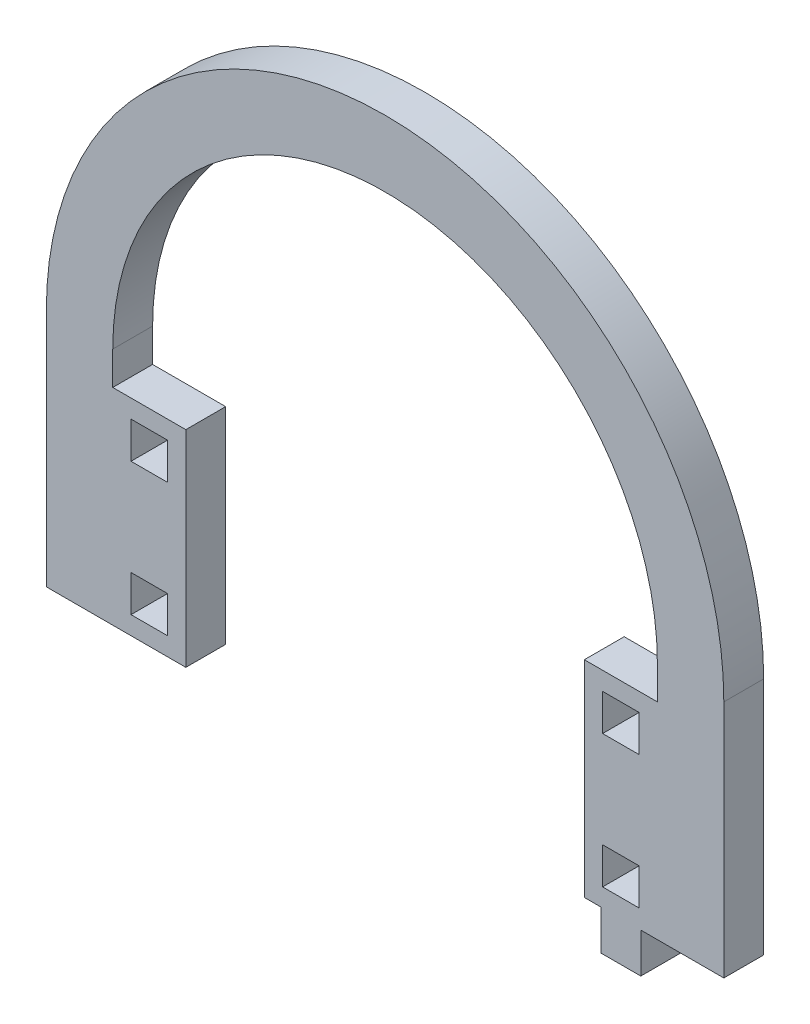
ISO-10303-21;
HEADER;
FILE_DESCRIPTION(('STEP AP214'),'2;1');
FILE_NAME('part.step','',(''),(''),'','','');
FILE_SCHEMA(('AUTOMOTIVE_DESIGN { 1 0 10303 214 1 1 1 1 }'));
ENDSEC;
DATA;
#1=APPLICATION_CONTEXT('core data for automotive mechanical design processes');
#2=APPLICATION_PROTOCOL_DEFINITION('international standard','automotive_design',2000,#1);
#3=PRODUCT_CONTEXT('',#1,'mechanical');
#4=PRODUCT('Part','Part','',(#3));
#5=PRODUCT_RELATED_PRODUCT_CATEGORY('part','',(#4));
#6=PRODUCT_DEFINITION_FORMATION('','',#4);
#7=PRODUCT_DEFINITION_CONTEXT('part definition',#1,'design');
#8=PRODUCT_DEFINITION('design','',#6,#7);
#9=PRODUCT_DEFINITION_SHAPE('','',#8);
#10=(LENGTH_UNIT() NAMED_UNIT(*) SI_UNIT(.MILLI.,.METRE.));
#11=(NAMED_UNIT(*) PLANE_ANGLE_UNIT() SI_UNIT($,.RADIAN.));
#12=(NAMED_UNIT(*) SI_UNIT($,.STERADIAN.) SOLID_ANGLE_UNIT());
#13=UNCERTAINTY_MEASURE_WITH_UNIT(LENGTH_MEASURE(1.E-05),#10,'distance_accuracy_value','');
#14=(GEOMETRIC_REPRESENTATION_CONTEXT(3) GLOBAL_UNCERTAINTY_ASSIGNED_CONTEXT((#13)) GLOBAL_UNIT_ASSIGNED_CONTEXT((#10,
#11,#12)) REPRESENTATION_CONTEXT('',''));
#15=CARTESIAN_POINT('',(0.,0.,0.));
#16=DIRECTION('',(0.,0.,1.));
#17=DIRECTION('',(1.,0.,0.));
#18=AXIS2_PLACEMENT_3D('',#15,#16,#17);
#19=CARTESIAN_POINT('',(3127.5327778246,1463.17134273567,6.));
#20=DIRECTION('',(0.,0.,1.));
#21=DIRECTION('',(1.,0.,0.));
#22=AXIS2_PLACEMENT_3D('',#19,#20,#21);
#23=PLANE('',#22);
#24=CARTESIAN_POINT('',(3127.5327778246,1463.17134273567,6.));
#25=DIRECTION('',(0.,0.,1.));
#26=DIRECTION('',(1.,0.,0.));
#27=AXIS2_PLACEMENT_3D('',#24,#25,#26);
#28=CIRCLE('',#27,51.0000000000002);
#29=CARTESIAN_POINT('',(3178.5327778246,1463.17134273567,6.));
#30=VERTEX_POINT('',#29);
#31=CARTESIAN_POINT('',(3076.5327778246,1463.17134273567,6.));
#32=VERTEX_POINT('',#31);
#33=EDGE_CURVE('E678',#30,#32,#28,.T.);
#34=ORIENTED_EDGE('',*,*,#33,.T.);
#35=DIRECTION('',(0.,-1.,0.));
#36=VECTOR('',#35,1.);
#37=CARTESIAN_POINT('',(3076.5327778246,1463.17134273567,6.));
#38=LINE('',#37,#36);
#39=CARTESIAN_POINT('',(3076.5327778246,1427.17134273567,6.));
#40=VERTEX_POINT('',#39);
#41=EDGE_CURVE('E682',#32,#40,#38,.T.);
#42=ORIENTED_EDGE('',*,*,#41,.T.);
#43=DIRECTION('',(1.,0.,0.));
#44=VECTOR('',#43,1.);
#45=CARTESIAN_POINT('',(3076.5327778246,1427.17134273567,6.));
#46=LINE('',#45,#44);
#47=CARTESIAN_POINT('',(3097.5327778246,1427.17134273567,6.));
#48=VERTEX_POINT('',#47);
#49=EDGE_CURVE('E686',#40,#48,#46,.T.);
#50=ORIENTED_EDGE('',*,*,#49,.T.);
#51=DIRECTION('',(0.,-1.,0.));
#52=VECTOR('',#51,1.);
#53=CARTESIAN_POINT('',(3097.5327778246,1458.17134273567,6.));
#54=LINE('',#53,#52);
#55=CARTESIAN_POINT('',(3097.5327778246,1458.17134273567,6.));
#56=VERTEX_POINT('',#55);
#57=EDGE_CURVE('E689',#56,#48,#54,.T.);
#58=ORIENTED_EDGE('',*,*,#57,.F.);
#59=DIRECTION('',(-1.,0.,0.));
#60=VECTOR('',#59,1.);
#61=CARTESIAN_POINT('',(3097.5327778246,1458.17134273567,6.));
#62=LINE('',#61,#60);
#63=CARTESIAN_POINT('',(3086.5327778246,1458.17134273567,6.));
#64=VERTEX_POINT('',#63);
#65=EDGE_CURVE('E693',#56,#64,#62,.T.);
#66=ORIENTED_EDGE('',*,*,#65,.T.);
#67=DIRECTION('',(-1.7763568394006E-13,-1.,0.));
#68=VECTOR('',#67,1.);
#69=CARTESIAN_POINT('',(3086.5327778246,1463.17134273567,6.));
#70=LINE('',#69,#68);
#71=CARTESIAN_POINT('',(3086.5327778246,1463.17134273567,6.));
#72=VERTEX_POINT('',#71);
#73=EDGE_CURVE('E696',#72,#64,#70,.T.);
#74=ORIENTED_EDGE('',*,*,#73,.F.);
#75=CARTESIAN_POINT('',(3127.5327778246,1463.17134273567,6.));
#76=DIRECTION('',(0.,0.,1.));
#77=DIRECTION('',(1.,0.,0.));
#78=AXIS2_PLACEMENT_3D('',#75,#76,#77);
#79=CIRCLE('',#78,40.9999999999999);
#80=CARTESIAN_POINT('',(3168.5327778246,1463.17134273567,6.));
#81=VERTEX_POINT('',#80);
#82=EDGE_CURVE('E700',#81,#72,#79,.T.);
#83=ORIENTED_EDGE('',*,*,#82,.F.);
#84=DIRECTION('',(-1.7763568394006E-13,-1.,0.));
#85=VECTOR('',#84,1.);
#86=CARTESIAN_POINT('',(3168.5327778246,1463.17134273567,6.));
#87=LINE('',#86,#85);
#88=CARTESIAN_POINT('',(3168.5327778246,1458.17134273567,6.));
#89=VERTEX_POINT('',#88);
#90=EDGE_CURVE('E704',#81,#89,#87,.T.);
#91=ORIENTED_EDGE('',*,*,#90,.T.);
#92=DIRECTION('',(-1.,0.,0.));
#93=VECTOR('',#92,1.);
#94=CARTESIAN_POINT('',(3168.5327778246,1458.17134273567,6.));
#95=LINE('',#94,#93);
#96=CARTESIAN_POINT('',(3157.5327778246,1458.17134273567,6.));
#97=VERTEX_POINT('',#96);
#98=EDGE_CURVE('E707',#89,#97,#95,.T.);
#99=ORIENTED_EDGE('',*,*,#98,.T.);
#100=DIRECTION('',(0.,-1.,0.));
#101=VECTOR('',#100,1.);
#102=CARTESIAN_POINT('',(3157.5327778246,1458.17134273567,6.));
#103=LINE('',#102,#101);
#104=CARTESIAN_POINT('',(3157.5327778246,1427.17134273567,6.));
#105=VERTEX_POINT('',#104);
#106=EDGE_CURVE('E710',#97,#105,#103,.T.);
#107=ORIENTED_EDGE('',*,*,#106,.T.);
#108=DIRECTION('',(1.,0.,0.));
#109=VECTOR('',#108,1.);
#110=CARTESIAN_POINT('',(3157.5327778246,1427.17134273567,6.));
#111=LINE('',#110,#109);
#112=CARTESIAN_POINT('',(3160.0327778246,1427.17134273567,6.));
#113=VERTEX_POINT('',#112);
#114=EDGE_CURVE('E713',#105,#113,#111,.T.);
#115=ORIENTED_EDGE('',*,*,#114,.T.);
#116=DIRECTION('',(0.,-1.,0.));
#117=VECTOR('',#116,1.);
#118=CARTESIAN_POINT('',(3160.0327778246,1427.17134273567,6.));
#119=LINE('',#118,#117);
#120=CARTESIAN_POINT('',(3160.0327778246,1421.17134273567,6.));
#121=VERTEX_POINT('',#120);
#122=EDGE_CURVE('E716',#113,#121,#119,.T.);
#123=ORIENTED_EDGE('',*,*,#122,.T.);
#124=DIRECTION('',(1.,0.,0.));
#125=VECTOR('',#124,1.);
#126=CARTESIAN_POINT('',(3160.0327778246,1421.17134273567,6.));
#127=LINE('',#126,#125);
#128=CARTESIAN_POINT('',(3166.0327778246,1421.17134273567,6.));
#129=VERTEX_POINT('',#128);
#130=EDGE_CURVE('E719',#121,#129,#127,.T.);
#131=ORIENTED_EDGE('',*,*,#130,.T.);
#132=DIRECTION('',(0.,1.,0.));
#133=VECTOR('',#132,1.);
#134=CARTESIAN_POINT('',(3166.0327778246,1421.17134273567,6.));
#135=LINE('',#134,#133);
#136=CARTESIAN_POINT('',(3166.0327778246,1427.17134273567,6.));
#137=VERTEX_POINT('',#136);
#138=EDGE_CURVE('E722',#129,#137,#135,.T.);
#139=ORIENTED_EDGE('',*,*,#138,.T.);
#140=DIRECTION('',(1.,0.,0.));
#141=VECTOR('',#140,1.);
#142=CARTESIAN_POINT('',(3166.0327778246,1427.17134273567,6.));
#143=LINE('',#142,#141);
#144=CARTESIAN_POINT('',(3178.5327778246,1427.17134273567,6.));
#145=VERTEX_POINT('',#144);
#146=EDGE_CURVE('E725',#137,#145,#143,.T.);
#147=ORIENTED_EDGE('',*,*,#146,.T.);
#148=DIRECTION('',(0.,-1.,0.));
#149=VECTOR('',#148,1.);
#150=CARTESIAN_POINT('',(3178.5327778246,1463.17134273567,6.));
#151=LINE('',#150,#149);
#152=EDGE_CURVE('E728',#30,#145,#151,.T.);
#153=ORIENTED_EDGE('',*,*,#152,.F.);
#154=EDGE_LOOP('',(#34,#42,#50,#58,#66,#74,#83,#91,#99,#107,#115,#123,#131,#139,#147,#153));
#155=FACE_BOUND('',#154,.T.);
#156=DIRECTION('',(0.,1.,0.));
#157=VECTOR('',#156,1.);
#158=CARTESIAN_POINT('',(3094.7827778246,0.,6.));
#159=LINE('',#158,#157);
#160=CARTESIAN_POINT('',(3094.7827778246,1449.92134273567,6.));
#161=VERTEX_POINT('',#160);
#162=CARTESIAN_POINT('',(3094.7827778246,1455.42134273567,6.));
#163=VERTEX_POINT('',#162);
#164=EDGE_CURVE('E638',#161,#163,#159,.T.);
#165=ORIENTED_EDGE('',*,*,#164,.F.);
#166=DIRECTION('',(1.,0.,0.));
#167=VECTOR('',#166,1.);
#168=CARTESIAN_POINT('',(0.,1449.92134273567,6.));
#169=LINE('',#168,#167);
#170=CARTESIAN_POINT('',(3089.2827778246,1449.92134273567,6.));
#171=VERTEX_POINT('',#170);
#172=EDGE_CURVE('E635',#171,#161,#169,.T.);
#173=ORIENTED_EDGE('',*,*,#172,.F.);
#174=DIRECTION('',(0.,-1.,0.));
#175=VECTOR('',#174,1.);
#176=CARTESIAN_POINT('',(3089.2827778246,0.,6.));
#177=LINE('',#176,#175);
#178=CARTESIAN_POINT('',(3089.2827778246,1455.42134273567,6.));
#179=VERTEX_POINT('',#178);
#180=EDGE_CURVE('E646',#179,#171,#177,.T.);
#181=ORIENTED_EDGE('',*,*,#180,.F.);
#182=DIRECTION('',(-1.,0.,0.));
#183=VECTOR('',#182,1.);
#184=CARTESIAN_POINT('',(0.,1455.42134273567,6.));
#185=LINE('',#184,#183);
#186=EDGE_CURVE('E642',#163,#179,#185,.T.);
#187=ORIENTED_EDGE('',*,*,#186,.F.);
#188=EDGE_LOOP('',(#165,#173,#181,#187));
#189=FACE_BOUND('',#188,.T.);
#190=DIRECTION('',(0.,1.,0.));
#191=VECTOR('',#190,1.);
#192=CARTESIAN_POINT('',(3094.7827778246,0.,6.));
#193=LINE('',#192,#191);
#194=CARTESIAN_POINT('',(3094.7827778246,1429.92134273567,6.));
#195=VERTEX_POINT('',#194);
#196=CARTESIAN_POINT('',(3094.7827778246,1435.42134273567,6.));
#197=VERTEX_POINT('',#196);
#198=EDGE_CURVE('E595',#195,#197,#193,.T.);
#199=ORIENTED_EDGE('',*,*,#198,.F.);
#200=DIRECTION('',(1.,0.,0.));
#201=VECTOR('',#200,1.);
#202=CARTESIAN_POINT('',(0.,1429.92134273567,6.));
#203=LINE('',#202,#201);
#204=CARTESIAN_POINT('',(3089.2827778246,1429.92134273567,6.));
#205=VERTEX_POINT('',#204);
#206=EDGE_CURVE('E592',#205,#195,#203,.T.);
#207=ORIENTED_EDGE('',*,*,#206,.F.);
#208=DIRECTION('',(0.,-1.,0.));
#209=VECTOR('',#208,1.);
#210=CARTESIAN_POINT('',(3089.2827778246,0.,6.));
#211=LINE('',#210,#209);
#212=CARTESIAN_POINT('',(3089.2827778246,1435.42134273567,6.));
#213=VERTEX_POINT('',#212);
#214=EDGE_CURVE('E603',#213,#205,#211,.T.);
#215=ORIENTED_EDGE('',*,*,#214,.F.);
#216=DIRECTION('',(-1.,0.,0.));
#217=VECTOR('',#216,1.);
#218=CARTESIAN_POINT('',(0.,1435.42134273567,6.));
#219=LINE('',#218,#217);
#220=EDGE_CURVE('E599',#197,#213,#219,.T.);
#221=ORIENTED_EDGE('',*,*,#220,.F.);
#222=EDGE_LOOP('',(#199,#207,#215,#221));
#223=FACE_BOUND('',#222,.T.);
#224=DIRECTION('',(0.,1.,0.));
#225=VECTOR('',#224,1.);
#226=CARTESIAN_POINT('',(3165.7827778246,0.,6.));
#227=LINE('',#226,#225);
#228=CARTESIAN_POINT('',(3165.7827778246,1449.92134273567,6.));
#229=VERTEX_POINT('',#228);
#230=CARTESIAN_POINT('',(3165.7827778246,1455.42134273567,6.));
#231=VERTEX_POINT('',#230);
#232=EDGE_CURVE('E552',#229,#231,#227,.T.);
#233=ORIENTED_EDGE('',*,*,#232,.F.);
#234=DIRECTION('',(1.,0.,0.));
#235=VECTOR('',#234,1.);
#236=CARTESIAN_POINT('',(0.,1449.92134273567,6.));
#237=LINE('',#236,#235);
#238=CARTESIAN_POINT('',(3160.2827778246,1449.92134273567,6.));
#239=VERTEX_POINT('',#238);
#240=EDGE_CURVE('E549',#239,#229,#237,.T.);
#241=ORIENTED_EDGE('',*,*,#240,.F.);
#242=DIRECTION('',(0.,-1.,0.));
#243=VECTOR('',#242,1.);
#244=CARTESIAN_POINT('',(3160.2827778246,0.,6.));
#245=LINE('',#244,#243);
#246=CARTESIAN_POINT('',(3160.2827778246,1455.42134273567,6.));
#247=VERTEX_POINT('',#246);
#248=EDGE_CURVE('E560',#247,#239,#245,.T.);
#249=ORIENTED_EDGE('',*,*,#248,.F.);
#250=DIRECTION('',(-1.,0.,0.));
#251=VECTOR('',#250,1.);
#252=CARTESIAN_POINT('',(0.,1455.42134273567,6.));
#253=LINE('',#252,#251);
#254=EDGE_CURVE('E556',#231,#247,#253,.T.);
#255=ORIENTED_EDGE('',*,*,#254,.F.);
#256=EDGE_LOOP('',(#233,#241,#249,#255));
#257=FACE_BOUND('',#256,.T.);
#258=DIRECTION('',(0.,1.,0.));
#259=VECTOR('',#258,1.);
#260=CARTESIAN_POINT('',(3165.7827778246,0.,6.));
#261=LINE('',#260,#259);
#262=CARTESIAN_POINT('',(3165.7827778246,1429.92134273567,6.));
#263=VERTEX_POINT('',#262);
#264=CARTESIAN_POINT('',(3165.7827778246,1435.42134273567,6.));
#265=VERTEX_POINT('',#264);
#266=EDGE_CURVE('E510',#263,#265,#261,.T.);
#267=ORIENTED_EDGE('',*,*,#266,.F.);
#268=DIRECTION('',(1.,0.,0.));
#269=VECTOR('',#268,1.);
#270=CARTESIAN_POINT('',(0.,1429.92134273567,6.));
#271=LINE('',#270,#269);
#272=CARTESIAN_POINT('',(3160.2827778246,1429.92134273567,6.));
#273=VERTEX_POINT('',#272);
#274=EDGE_CURVE('E501',#273,#263,#271,.T.);
#275=ORIENTED_EDGE('',*,*,#274,.F.);
#276=DIRECTION('',(0.,-1.,0.));
#277=VECTOR('',#276,1.);
#278=CARTESIAN_POINT('',(3160.2827778246,0.,6.));
#279=LINE('',#278,#277);
#280=CARTESIAN_POINT('',(3160.2827778246,1435.42134273567,6.));
#281=VERTEX_POINT('',#280);
#282=EDGE_CURVE('E527',#281,#273,#279,.T.);
#283=ORIENTED_EDGE('',*,*,#282,.F.);
#284=DIRECTION('',(-1.,0.,0.));
#285=VECTOR('',#284,1.);
#286=CARTESIAN_POINT('',(0.,1435.42134273567,6.));
#287=LINE('',#286,#285);
#288=EDGE_CURVE('E523',#265,#281,#287,.T.);
#289=ORIENTED_EDGE('',*,*,#288,.F.);
#290=EDGE_LOOP('',(#267,#275,#283,#289));
#291=FACE_BOUND('',#290,.T.);
#292=ADVANCED_FACE('F291',(#155,#189,#223,#257,#291),#23,.T.);
#293=CARTESIAN_POINT('',(3127.5327778246,1463.17134273567,0.));
#294=DIRECTION('',(0.,0.,1.));
#295=DIRECTION('',(1.,0.,0.));
#296=AXIS2_PLACEMENT_3D('',#293,#294,#295);
#297=PLANE('',#296);
#298=DIRECTION('',(1.,0.,0.));
#299=VECTOR('',#298,1.);
#300=CARTESIAN_POINT('',(0.,1449.92134273567,0.));
#301=LINE('',#300,#299);
#302=CARTESIAN_POINT('',(3160.2827778246,1449.92134273567,0.));
#303=VERTEX_POINT('',#302);
#304=CARTESIAN_POINT('',(3165.7827778246,1449.92134273567,0.));
#305=VERTEX_POINT('',#304);
#306=EDGE_CURVE('E519',#303,#305,#301,.T.);
#307=ORIENTED_EDGE('',*,*,#306,.T.);
#308=DIRECTION('',(0.,1.,0.));
#309=VECTOR('',#308,1.);
#310=CARTESIAN_POINT('',(3165.7827778246,0.,0.));
#311=LINE('',#310,#309);
#312=CARTESIAN_POINT('',(3165.7827778246,1455.42134273567,0.));
#313=VERTEX_POINT('',#312);
#314=EDGE_CURVE('E567',#305,#313,#311,.T.);
#315=ORIENTED_EDGE('',*,*,#314,.T.);
#316=DIRECTION('',(-1.,0.,0.));
#317=VECTOR('',#316,1.);
#318=CARTESIAN_POINT('',(0.,1455.42134273567,0.));
#319=LINE('',#318,#317);
#320=CARTESIAN_POINT('',(3160.2827778246,1455.42134273567,0.));
#321=VERTEX_POINT('',#320);
#322=EDGE_CURVE('E571',#313,#321,#319,.T.);
#323=ORIENTED_EDGE('',*,*,#322,.T.);
#324=DIRECTION('',(0.,-1.,0.));
#325=VECTOR('',#324,1.);
#326=CARTESIAN_POINT('',(3160.2827778246,0.,0.));
#327=LINE('',#326,#325);
#328=EDGE_CURVE('E553',#321,#303,#327,.T.);
#329=ORIENTED_EDGE('',*,*,#328,.T.);
#330=EDGE_LOOP('',(#307,#315,#323,#329));
#331=FACE_BOUND('',#330,.T.);
#332=DIRECTION('',(1.,0.,0.));
#333=VECTOR('',#332,1.);
#334=CARTESIAN_POINT('',(0.,1449.92134273567,0.));
#335=LINE('',#334,#333);
#336=CARTESIAN_POINT('',(3089.2827778246,1449.92134273567,0.));
#337=VERTEX_POINT('',#336);
#338=CARTESIAN_POINT('',(3094.7827778246,1449.92134273567,0.));
#339=VERTEX_POINT('',#338);
#340=EDGE_CURVE('E634',#337,#339,#335,.T.);
#341=ORIENTED_EDGE('',*,*,#340,.T.);
#342=DIRECTION('',(0.,1.,0.));
#343=VECTOR('',#342,1.);
#344=CARTESIAN_POINT('',(3094.7827778246,0.,0.));
#345=LINE('',#344,#343);
#346=CARTESIAN_POINT('',(3094.7827778246,1455.42134273567,0.));
#347=VERTEX_POINT('',#346);
#348=EDGE_CURVE('E653',#339,#347,#345,.T.);
#349=ORIENTED_EDGE('',*,*,#348,.T.);
#350=DIRECTION('',(-1.,0.,0.));
#351=VECTOR('',#350,1.);
#352=CARTESIAN_POINT('',(0.,1455.42134273567,0.));
#353=LINE('',#352,#351);
#354=CARTESIAN_POINT('',(3089.2827778246,1455.42134273567,0.));
#355=VERTEX_POINT('',#354);
#356=EDGE_CURVE('E657',#347,#355,#353,.T.);
#357=ORIENTED_EDGE('',*,*,#356,.T.);
#358=DIRECTION('',(0.,-1.,0.));
#359=VECTOR('',#358,1.);
#360=CARTESIAN_POINT('',(3089.2827778246,0.,0.));
#361=LINE('',#360,#359);
#362=EDGE_CURVE('E639',#355,#337,#361,.T.);
#363=ORIENTED_EDGE('',*,*,#362,.T.);
#364=EDGE_LOOP('',(#341,#349,#357,#363));
#365=FACE_BOUND('',#364,.T.);
#366=CARTESIAN_POINT('',(3127.5327778246,1463.17134273567,0.));
#367=DIRECTION('',(0.,0.,1.));
#368=DIRECTION('',(1.,0.,0.));
#369=AXIS2_PLACEMENT_3D('',#366,#367,#368);
#370=CIRCLE('',#369,51.0000000000002);
#371=CARTESIAN_POINT('',(3178.5327778246,1463.17134273567,0.));
#372=VERTEX_POINT('',#371);
#373=CARTESIAN_POINT('',(3076.5327778246,1463.17134273567,0.));
#374=VERTEX_POINT('',#373);
#375=EDGE_CURVE('E677',#372,#374,#370,.T.);
#376=ORIENTED_EDGE('',*,*,#375,.F.);
#377=DIRECTION('',(0.,-1.,0.));
#378=VECTOR('',#377,1.);
#379=CARTESIAN_POINT('',(3178.5327778246,1463.17134273567,0.));
#380=LINE('',#379,#378);
#381=CARTESIAN_POINT('',(3178.5327778246,1427.17134273567,0.));
#382=VERTEX_POINT('',#381);
#383=EDGE_CURVE('E683',#372,#382,#380,.T.);
#384=ORIENTED_EDGE('',*,*,#383,.T.);
#385=DIRECTION('',(1.,0.,0.));
#386=VECTOR('',#385,1.);
#387=CARTESIAN_POINT('',(3166.0327778246,1427.17134273567,0.));
#388=LINE('',#387,#386);
#389=CARTESIAN_POINT('',(3166.0327778246,1427.17134273567,0.));
#390=VERTEX_POINT('',#389);
#391=EDGE_CURVE('E781',#390,#382,#388,.T.);
#392=ORIENTED_EDGE('',*,*,#391,.F.);
#393=DIRECTION('',(0.,1.,0.));
#394=VECTOR('',#393,1.);
#395=CARTESIAN_POINT('',(3166.0327778246,1421.17134273567,0.));
#396=LINE('',#395,#394);
#397=CARTESIAN_POINT('',(3166.0327778246,1421.17134273567,0.));
#398=VERTEX_POINT('',#397);
#399=EDGE_CURVE('E778',#398,#390,#396,.T.);
#400=ORIENTED_EDGE('',*,*,#399,.F.);
#401=DIRECTION('',(1.,0.,0.));
#402=VECTOR('',#401,1.);
#403=CARTESIAN_POINT('',(3160.0327778246,1421.17134273567,0.));
#404=LINE('',#403,#402);
#405=CARTESIAN_POINT('',(3160.0327778246,1421.17134273567,0.));
#406=VERTEX_POINT('',#405);
#407=EDGE_CURVE('E775',#406,#398,#404,.T.);
#408=ORIENTED_EDGE('',*,*,#407,.F.);
#409=DIRECTION('',(0.,-1.,0.));
#410=VECTOR('',#409,1.);
#411=CARTESIAN_POINT('',(3160.0327778246,1427.17134273567,0.));
#412=LINE('',#411,#410);
#413=CARTESIAN_POINT('',(3160.0327778246,1427.17134273567,0.));
#414=VERTEX_POINT('',#413);
#415=EDGE_CURVE('E772',#414,#406,#412,.T.);
#416=ORIENTED_EDGE('',*,*,#415,.F.);
#417=DIRECTION('',(1.,0.,0.));
#418=VECTOR('',#417,1.);
#419=CARTESIAN_POINT('',(3157.5327778246,1427.17134273567,0.));
#420=LINE('',#419,#418);
#421=CARTESIAN_POINT('',(3157.5327778246,1427.17134273567,0.));
#422=VERTEX_POINT('',#421);
#423=EDGE_CURVE('E769',#422,#414,#420,.T.);
#424=ORIENTED_EDGE('',*,*,#423,.F.);
#425=DIRECTION('',(0.,-1.,0.));
#426=VECTOR('',#425,1.);
#427=CARTESIAN_POINT('',(3157.5327778246,1458.17134273567,0.));
#428=LINE('',#427,#426);
#429=CARTESIAN_POINT('',(3157.5327778246,1458.17134273567,0.));
#430=VERTEX_POINT('',#429);
#431=EDGE_CURVE('E766',#430,#422,#428,.T.);
#432=ORIENTED_EDGE('',*,*,#431,.F.);
#433=DIRECTION('',(-1.,0.,0.));
#434=VECTOR('',#433,1.);
#435=CARTESIAN_POINT('',(3168.5327778246,1458.17134273567,0.));
#436=LINE('',#435,#434);
#437=CARTESIAN_POINT('',(3168.5327778246,1458.17134273567,0.));
#438=VERTEX_POINT('',#437);
#439=EDGE_CURVE('E763',#438,#430,#436,.T.);
#440=ORIENTED_EDGE('',*,*,#439,.F.);
#441=DIRECTION('',(-1.7763568394006E-13,-1.,0.));
#442=VECTOR('',#441,1.);
#443=CARTESIAN_POINT('',(3168.5327778246,1463.17134273567,0.));
#444=LINE('',#443,#442);
#445=CARTESIAN_POINT('',(3168.5327778246,1463.17134273567,0.));
#446=VERTEX_POINT('',#445);
#447=EDGE_CURVE('E760',#446,#438,#444,.T.);
#448=ORIENTED_EDGE('',*,*,#447,.F.);
#449=CARTESIAN_POINT('',(3127.5327778246,1463.17134273567,0.));
#450=DIRECTION('',(0.,0.,1.));
#451=DIRECTION('',(1.,0.,0.));
#452=AXIS2_PLACEMENT_3D('',#449,#450,#451);
#453=CIRCLE('',#452,40.9999999999999);
#454=CARTESIAN_POINT('',(3086.5327778246,1463.17134273567,0.));
#455=VERTEX_POINT('',#454);
#456=EDGE_CURVE('E756',#446,#455,#453,.T.);
#457=ORIENTED_EDGE('',*,*,#456,.T.);
#458=DIRECTION('',(-1.7763568394006E-13,-1.,0.));
#459=VECTOR('',#458,1.);
#460=CARTESIAN_POINT('',(3086.5327778246,1463.17134273567,0.));
#461=LINE('',#460,#459);
#462=CARTESIAN_POINT('',(3086.5327778246,1458.17134273567,0.));
#463=VERTEX_POINT('',#462);
#464=EDGE_CURVE('E752',#455,#463,#461,.T.);
#465=ORIENTED_EDGE('',*,*,#464,.T.);
#466=DIRECTION('',(-1.,0.,0.));
#467=VECTOR('',#466,1.);
#468=CARTESIAN_POINT('',(3097.5327778246,1458.17134273567,0.));
#469=LINE('',#468,#467);
#470=CARTESIAN_POINT('',(3097.5327778246,1458.17134273567,0.));
#471=VERTEX_POINT('',#470);
#472=EDGE_CURVE('E748',#471,#463,#469,.T.);
#473=ORIENTED_EDGE('',*,*,#472,.F.);
#474=DIRECTION('',(0.,-1.,0.));
#475=VECTOR('',#474,1.);
#476=CARTESIAN_POINT('',(3097.5327778246,1458.17134273567,0.));
#477=LINE('',#476,#475);
#478=CARTESIAN_POINT('',(3097.5327778246,1427.17134273567,0.));
#479=VERTEX_POINT('',#478);
#480=EDGE_CURVE('E744',#471,#479,#477,.T.);
#481=ORIENTED_EDGE('',*,*,#480,.T.);
#482=DIRECTION('',(1.,0.,0.));
#483=VECTOR('',#482,1.);
#484=CARTESIAN_POINT('',(3086.5327778246,1427.17134273567,0.));
#485=LINE('',#484,#483);
#486=CARTESIAN_POINT('',(3076.5327778246,1427.17134273567,0.));
#487=VERTEX_POINT('',#486);
#488=EDGE_CURVE('E740',#487,#479,#485,.T.);
#489=ORIENTED_EDGE('',*,*,#488,.F.);
#490=DIRECTION('',(0.,-1.,0.));
#491=VECTOR('',#490,1.);
#492=CARTESIAN_POINT('',(3076.5327778246,1463.17134273567,0.));
#493=LINE('',#492,#491);
#494=EDGE_CURVE('E736',#374,#487,#493,.T.);
#495=ORIENTED_EDGE('',*,*,#494,.F.);
#496=EDGE_LOOP('',(#376,#384,#392,#400,#408,#416,#424,#432,#440,#448,#457,#465,#473,#481,#489,#495));
#497=FACE_BOUND('',#496,.T.);
#498=DIRECTION('',(1.,0.,0.));
#499=VECTOR('',#498,1.);
#500=CARTESIAN_POINT('',(0.,1429.92134273567,0.));
#501=LINE('',#500,#499);
#502=CARTESIAN_POINT('',(3089.2827778246,1429.92134273567,0.));
#503=VERTEX_POINT('',#502);
#504=CARTESIAN_POINT('',(3094.7827778246,1429.92134273567,0.));
#505=VERTEX_POINT('',#504);
#506=EDGE_CURVE('E591',#503,#505,#501,.T.);
#507=ORIENTED_EDGE('',*,*,#506,.T.);
#508=DIRECTION('',(0.,1.,0.));
#509=VECTOR('',#508,1.);
#510=CARTESIAN_POINT('',(3094.7827778246,0.,0.));
#511=LINE('',#510,#509);
#512=CARTESIAN_POINT('',(3094.7827778246,1435.42134273567,0.));
#513=VERTEX_POINT('',#512);
#514=EDGE_CURVE('E610',#505,#513,#511,.T.);
#515=ORIENTED_EDGE('',*,*,#514,.T.);
#516=DIRECTION('',(-1.,0.,0.));
#517=VECTOR('',#516,1.);
#518=CARTESIAN_POINT('',(0.,1435.42134273567,0.));
#519=LINE('',#518,#517);
#520=CARTESIAN_POINT('',(3089.2827778246,1435.42134273567,0.));
#521=VERTEX_POINT('',#520);
#522=EDGE_CURVE('E614',#513,#521,#519,.T.);
#523=ORIENTED_EDGE('',*,*,#522,.T.);
#524=DIRECTION('',(0.,-1.,0.));
#525=VECTOR('',#524,1.);
#526=CARTESIAN_POINT('',(3089.2827778246,0.,0.));
#527=LINE('',#526,#525);
#528=EDGE_CURVE('E596',#521,#503,#527,.T.);
#529=ORIENTED_EDGE('',*,*,#528,.T.);
#530=EDGE_LOOP('',(#507,#515,#523,#529));
#531=FACE_BOUND('',#530,.T.);
#532=DIRECTION('',(1.,0.,0.));
#533=VECTOR('',#532,1.);
#534=CARTESIAN_POINT('',(0.,1429.92134273567,0.));
#535=LINE('',#534,#533);
#536=CARTESIAN_POINT('',(3160.2827778246,1429.92134273567,0.));
#537=VERTEX_POINT('',#536);
#538=CARTESIAN_POINT('',(3165.7827778246,1429.92134273567,0.));
#539=VERTEX_POINT('',#538);
#540=EDGE_CURVE('E315',#537,#539,#535,.T.);
#541=ORIENTED_EDGE('',*,*,#540,.T.);
#542=DIRECTION('',(0.,1.,0.));
#543=VECTOR('',#542,1.);
#544=CARTESIAN_POINT('',(3165.7827778246,0.,0.));
#545=LINE('',#544,#543);
#546=CARTESIAN_POINT('',(3165.7827778246,1435.42134273567,0.));
#547=VERTEX_POINT('',#546);
#548=EDGE_CURVE('E517',#539,#547,#545,.T.);
#549=ORIENTED_EDGE('',*,*,#548,.T.);
#550=DIRECTION('',(-1.,0.,0.));
#551=VECTOR('',#550,1.);
#552=CARTESIAN_POINT('',(0.,1435.42134273567,0.));
#553=LINE('',#552,#551);
#554=CARTESIAN_POINT('',(3160.2827778246,1435.42134273567,0.));
#555=VERTEX_POINT('',#554);
#556=EDGE_CURVE('E536',#547,#555,#553,.T.);
#557=ORIENTED_EDGE('',*,*,#556,.T.);
#558=DIRECTION('',(0.,-1.,0.));
#559=VECTOR('',#558,1.);
#560=CARTESIAN_POINT('',(3160.2827778246,0.,0.));
#561=LINE('',#560,#559);
#562=EDGE_CURVE('E511',#555,#537,#561,.T.);
#563=ORIENTED_EDGE('',*,*,#562,.T.);
#564=EDGE_LOOP('',(#541,#549,#557,#563));
#565=FACE_BOUND('',#564,.T.);
#566=ADVANCED_FACE('F847',(#331,#365,#497,#531,#565),#297,.F.);
#567=CARTESIAN_POINT('',(3127.5327778246,1463.17134273567,6.));
#568=DIRECTION('',(0.,0.,-1.));
#569=DIRECTION('',(-1.,0.,0.));
#570=AXIS2_PLACEMENT_3D('',#567,#568,#569);
#571=CYLINDRICAL_SURFACE('',#570,51.0000000000002);
#572=ORIENTED_EDGE('',*,*,#375,.T.);
#573=DIRECTION('',(0.,0.,-1.));
#574=VECTOR('',#573,1.);
#575=CARTESIAN_POINT('',(3076.5327778246,1463.17134273567,6.));
#576=LINE('',#575,#574);
#577=EDGE_CURVE('E12',#32,#374,#576,.T.);
#578=ORIENTED_EDGE('',*,*,#577,.F.);
#579=ORIENTED_EDGE('',*,*,#33,.F.);
#580=DIRECTION('',(0.,0.,-1.));
#581=VECTOR('',#580,1.);
#582=CARTESIAN_POINT('',(3178.5327778246,1463.17134273567,6.));
#583=LINE('',#582,#581);
#584=EDGE_CURVE('E732',#30,#372,#583,.T.);
#585=ORIENTED_EDGE('',*,*,#584,.T.);
#586=EDGE_LOOP('',(#572,#578,#579,#585));
#587=FACE_BOUND('',#586,.T.);
#588=ADVANCED_FACE('F293',(#587),#571,.T.);
#589=CARTESIAN_POINT('',(3076.5327778246,1463.17134273567,6.));
#590=DIRECTION('',(1.,0.,0.));
#591=DIRECTION('',(0.,1.,0.));
#592=AXIS2_PLACEMENT_3D('',#589,#590,#591);
#593=PLANE('',#592);
#594=ORIENTED_EDGE('',*,*,#494,.T.);
#595=DIRECTION('',(0.,0.,-1.));
#596=VECTOR('',#595,1.);
#597=CARTESIAN_POINT('',(3076.5327778246,1427.17134273567,6.));
#598=LINE('',#597,#596);
#599=EDGE_CURVE('E300',#40,#487,#598,.T.);
#600=ORIENTED_EDGE('',*,*,#599,.F.);
#601=ORIENTED_EDGE('',*,*,#41,.F.);
#602=ORIENTED_EDGE('',*,*,#577,.T.);
#603=EDGE_LOOP('',(#594,#600,#601,#602));
#604=FACE_BOUND('',#603,.T.);
#605=ADVANCED_FACE('F843',(#604),#593,.F.);
#606=CARTESIAN_POINT('',(3086.5327778246,1427.17134273567,6.));
#607=DIRECTION('',(0.,1.,0.));
#608=DIRECTION('',(0.,0.,1.));
#609=AXIS2_PLACEMENT_3D('',#606,#607,#608);
#610=PLANE('',#609);
#611=ORIENTED_EDGE('',*,*,#488,.T.);
#612=DIRECTION('',(0.,0.,-1.));
#613=VECTOR('',#612,1.);
#614=CARTESIAN_POINT('',(3097.5327778246,1427.17134273567,6.));
#615=LINE('',#614,#613);
#616=EDGE_CURVE('E833',#48,#479,#615,.T.);
#617=ORIENTED_EDGE('',*,*,#616,.F.);
#618=ORIENTED_EDGE('',*,*,#49,.F.);
#619=ORIENTED_EDGE('',*,*,#599,.T.);
#620=EDGE_LOOP('',(#611,#617,#618,#619));
#621=FACE_BOUND('',#620,.T.);
#622=ADVANCED_FACE('F840',(#621),#610,.F.);
#623=CARTESIAN_POINT('',(3097.5327778246,1458.17134273567,6.));
#624=DIRECTION('',(1.,0.,0.));
#625=DIRECTION('',(0.,0.,-1.));
#626=AXIS2_PLACEMENT_3D('',#623,#624,#625);
#627=PLANE('',#626);
#628=ORIENTED_EDGE('',*,*,#480,.F.);
#629=DIRECTION('',(0.,0.,-1.));
#630=VECTOR('',#629,1.);
#631=CARTESIAN_POINT('',(3097.5327778246,1458.17134273567,6.));
#632=LINE('',#631,#630);
#633=EDGE_CURVE('E830',#56,#471,#632,.T.);
#634=ORIENTED_EDGE('',*,*,#633,.F.);
#635=ORIENTED_EDGE('',*,*,#57,.T.);
#636=ORIENTED_EDGE('',*,*,#616,.T.);
#637=EDGE_LOOP('',(#628,#634,#635,#636));
#638=FACE_BOUND('',#637,.T.);
#639=ADVANCED_FACE('F853',(#638),#627,.T.);
#640=CARTESIAN_POINT('',(3097.5327778246,1458.17134273567,6.));
#641=DIRECTION('',(0.,-1.,0.));
#642=DIRECTION('',(0.,0.,-1.));
#643=AXIS2_PLACEMENT_3D('',#640,#641,#642);
#644=PLANE('',#643);
#645=ORIENTED_EDGE('',*,*,#472,.T.);
#646=DIRECTION('',(0.,0.,-1.));
#647=VECTOR('',#646,1.);
#648=CARTESIAN_POINT('',(3086.5327778246,1458.17134273567,6.));
#649=LINE('',#648,#647);
#650=EDGE_CURVE('E827',#64,#463,#649,.T.);
#651=ORIENTED_EDGE('',*,*,#650,.F.);
#652=ORIENTED_EDGE('',*,*,#65,.F.);
#653=ORIENTED_EDGE('',*,*,#633,.T.);
#654=EDGE_LOOP('',(#645,#651,#652,#653));
#655=FACE_BOUND('',#654,.T.);
#656=ADVANCED_FACE('F913',(#655),#644,.F.);
#657=CARTESIAN_POINT('',(3086.5327778246,1463.17134273567,6.));
#658=DIRECTION('',(1.,-1.7763568394006E-13,0.));
#659=DIRECTION('',(1.7763568394006E-13,1.,0.));
#660=AXIS2_PLACEMENT_3D('',#657,#658,#659);
#661=PLANE('',#660);
#662=ORIENTED_EDGE('',*,*,#464,.F.);
#663=DIRECTION('',(0.,0.,-1.));
#664=VECTOR('',#663,1.);
#665=CARTESIAN_POINT('',(3086.5327778246,1463.17134273567,6.));
#666=LINE('',#665,#664);
#667=EDGE_CURVE('E824',#72,#455,#666,.T.);
#668=ORIENTED_EDGE('',*,*,#667,.F.);
#669=ORIENTED_EDGE('',*,*,#73,.T.);
#670=ORIENTED_EDGE('',*,*,#650,.T.);
#671=EDGE_LOOP('',(#662,#668,#669,#670));
#672=FACE_BOUND('',#671,.T.);
#673=ADVANCED_FACE('F911',(#672),#661,.T.);
#674=CARTESIAN_POINT('',(3127.5327778246,1463.17134273567,6.));
#675=DIRECTION('',(0.,0.,-1.));
#676=DIRECTION('',(-1.,0.,0.));
#677=AXIS2_PLACEMENT_3D('',#674,#675,#676);
#678=CYLINDRICAL_SURFACE('',#677,40.9999999999999);
#679=ORIENTED_EDGE('',*,*,#456,.F.);
#680=DIRECTION('',(0.,0.,-1.));
#681=VECTOR('',#680,1.);
#682=CARTESIAN_POINT('',(3168.5327778246,1463.17134273567,6.));
#683=LINE('',#682,#681);
#684=EDGE_CURVE('E821',#81,#446,#683,.T.);
#685=ORIENTED_EDGE('',*,*,#684,.F.);
#686=ORIENTED_EDGE('',*,*,#82,.T.);
#687=ORIENTED_EDGE('',*,*,#667,.T.);
#688=EDGE_LOOP('',(#679,#685,#686,#687));
#689=FACE_BOUND('',#688,.T.);
#690=ADVANCED_FACE('F908',(#689),#678,.F.);
#691=CARTESIAN_POINT('',(3168.5327778246,1463.17134273567,6.));
#692=DIRECTION('',(1.,-1.7763568394006E-13,0.));
#693=DIRECTION('',(1.7763568394006E-13,1.,0.));
#694=AXIS2_PLACEMENT_3D('',#691,#692,#693);
#695=PLANE('',#694);
#696=ORIENTED_EDGE('',*,*,#447,.T.);
#697=DIRECTION('',(0.,0.,-1.));
#698=VECTOR('',#697,1.);
#699=CARTESIAN_POINT('',(3168.5327778246,1458.17134273567,6.));
#700=LINE('',#699,#698);
#701=EDGE_CURVE('E817',#89,#438,#700,.T.);
#702=ORIENTED_EDGE('',*,*,#701,.F.);
#703=ORIENTED_EDGE('',*,*,#90,.F.);
#704=ORIENTED_EDGE('',*,*,#684,.T.);
#705=EDGE_LOOP('',(#696,#702,#703,#704));
#706=FACE_BOUND('',#705,.T.);
#707=ADVANCED_FACE('F905',(#706),#695,.F.);
#708=CARTESIAN_POINT('',(3168.5327778246,1458.17134273567,6.));
#709=DIRECTION('',(0.,-1.,0.));
#710=DIRECTION('',(0.,0.,-1.));
#711=AXIS2_PLACEMENT_3D('',#708,#709,#710);
#712=PLANE('',#711);
#713=ORIENTED_EDGE('',*,*,#439,.T.);
#714=DIRECTION('',(0.,0.,-1.));
#715=VECTOR('',#714,1.);
#716=CARTESIAN_POINT('',(3157.5327778246,1458.17134273567,6.));
#717=LINE('',#716,#715);
#718=EDGE_CURVE('E813',#97,#430,#717,.T.);
#719=ORIENTED_EDGE('',*,*,#718,.F.);
#720=ORIENTED_EDGE('',*,*,#98,.F.);
#721=ORIENTED_EDGE('',*,*,#701,.T.);
#722=EDGE_LOOP('',(#713,#719,#720,#721));
#723=FACE_BOUND('',#722,.T.);
#724=ADVANCED_FACE('F900',(#723),#712,.F.);
#725=CARTESIAN_POINT('',(3157.5327778246,1458.17134273567,6.));
#726=DIRECTION('',(1.,0.,0.));
#727=DIRECTION('',(0.,0.,-1.));
#728=AXIS2_PLACEMENT_3D('',#725,#726,#727);
#729=PLANE('',#728);
#730=ORIENTED_EDGE('',*,*,#431,.T.);
#731=DIRECTION('',(0.,0.,-1.));
#732=VECTOR('',#731,1.);
#733=CARTESIAN_POINT('',(3157.5327778246,1427.17134273567,6.));
#734=LINE('',#733,#732);
#735=EDGE_CURVE('E809',#105,#422,#734,.T.);
#736=ORIENTED_EDGE('',*,*,#735,.F.);
#737=ORIENTED_EDGE('',*,*,#106,.F.);
#738=ORIENTED_EDGE('',*,*,#718,.T.);
#739=EDGE_LOOP('',(#730,#736,#737,#738));
#740=FACE_BOUND('',#739,.T.);
#741=ADVANCED_FACE('F894',(#740),#729,.F.);
#742=CARTESIAN_POINT('',(3157.5327778246,1427.17134273567,6.));
#743=DIRECTION('',(0.,1.,0.));
#744=DIRECTION('',(0.,0.,1.));
#745=AXIS2_PLACEMENT_3D('',#742,#743,#744);
#746=PLANE('',#745);
#747=ORIENTED_EDGE('',*,*,#423,.T.);
#748=DIRECTION('',(0.,0.,-1.));
#749=VECTOR('',#748,1.);
#750=CARTESIAN_POINT('',(3160.0327778246,1427.17134273567,6.));
#751=LINE('',#750,#749);
#752=EDGE_CURVE('E805',#113,#414,#751,.T.);
#753=ORIENTED_EDGE('',*,*,#752,.F.);
#754=ORIENTED_EDGE('',*,*,#114,.F.);
#755=ORIENTED_EDGE('',*,*,#735,.T.);
#756=EDGE_LOOP('',(#747,#753,#754,#755));
#757=FACE_BOUND('',#756,.T.);
#758=ADVANCED_FACE('F890',(#757),#746,.F.);
#759=CARTESIAN_POINT('',(3160.0327778246,1427.17134273567,6.));
#760=DIRECTION('',(1.,0.,0.));
#761=DIRECTION('',(0.,0.,-1.));
#762=AXIS2_PLACEMENT_3D('',#759,#760,#761);
#763=PLANE('',#762);
#764=ORIENTED_EDGE('',*,*,#415,.T.);
#765=DIRECTION('',(0.,0.,-1.));
#766=VECTOR('',#765,1.);
#767=CARTESIAN_POINT('',(3160.0327778246,1421.17134273567,6.));
#768=LINE('',#767,#766);
#769=EDGE_CURVE('E801',#121,#406,#768,.T.);
#770=ORIENTED_EDGE('',*,*,#769,.F.);
#771=ORIENTED_EDGE('',*,*,#122,.F.);
#772=ORIENTED_EDGE('',*,*,#752,.T.);
#773=EDGE_LOOP('',(#764,#770,#771,#772));
#774=FACE_BOUND('',#773,.T.);
#775=ADVANCED_FACE('F885',(#774),#763,.F.);
#776=CARTESIAN_POINT('',(3160.0327778246,1421.17134273567,6.));
#777=DIRECTION('',(0.,1.,0.));
#778=DIRECTION('',(0.,0.,1.));
#779=AXIS2_PLACEMENT_3D('',#776,#777,#778);
#780=PLANE('',#779);
#781=ORIENTED_EDGE('',*,*,#407,.T.);
#782=DIRECTION('',(0.,0.,-1.));
#783=VECTOR('',#782,1.);
#784=CARTESIAN_POINT('',(3166.0327778246,1421.17134273567,6.));
#785=LINE('',#784,#783);
#786=EDGE_CURVE('E797',#129,#398,#785,.T.);
#787=ORIENTED_EDGE('',*,*,#786,.F.);
#788=ORIENTED_EDGE('',*,*,#130,.F.);
#789=ORIENTED_EDGE('',*,*,#769,.T.);
#790=EDGE_LOOP('',(#781,#787,#788,#789));
#791=FACE_BOUND('',#790,.T.);
#792=ADVANCED_FACE('F879',(#791),#780,.F.);
#793=CARTESIAN_POINT('',(3166.0327778246,1421.17134273567,6.));
#794=DIRECTION('',(-1.,0.,0.));
#795=DIRECTION('',(0.,0.,1.));
#796=AXIS2_PLACEMENT_3D('',#793,#794,#795);
#797=PLANE('',#796);
#798=ORIENTED_EDGE('',*,*,#399,.T.);
#799=DIRECTION('',(0.,0.,-1.));
#800=VECTOR('',#799,1.);
#801=CARTESIAN_POINT('',(3166.0327778246,1427.17134273567,6.));
#802=LINE('',#801,#800);
#803=EDGE_CURVE('E793',#137,#390,#802,.T.);
#804=ORIENTED_EDGE('',*,*,#803,.F.);
#805=ORIENTED_EDGE('',*,*,#138,.F.);
#806=ORIENTED_EDGE('',*,*,#786,.T.);
#807=EDGE_LOOP('',(#798,#804,#805,#806));
#808=FACE_BOUND('',#807,.T.);
#809=ADVANCED_FACE('F875',(#808),#797,.F.);
#810=CARTESIAN_POINT('',(3166.0327778246,1427.17134273567,6.));
#811=DIRECTION('',(0.,1.,0.));
#812=DIRECTION('',(0.,0.,1.));
#813=AXIS2_PLACEMENT_3D('',#810,#811,#812);
#814=PLANE('',#813);
#815=ORIENTED_EDGE('',*,*,#391,.T.);
#816=DIRECTION('',(0.,0.,-1.));
#817=VECTOR('',#816,1.);
#818=CARTESIAN_POINT('',(3178.5327778246,1427.17134273567,6.));
#819=LINE('',#818,#817);
#820=EDGE_CURVE('E790',#145,#382,#819,.T.);
#821=ORIENTED_EDGE('',*,*,#820,.F.);
#822=ORIENTED_EDGE('',*,*,#146,.F.);
#823=ORIENTED_EDGE('',*,*,#803,.T.);
#824=EDGE_LOOP('',(#815,#821,#822,#823));
#825=FACE_BOUND('',#824,.T.);
#826=ADVANCED_FACE('F870',(#825),#814,.F.);
#827=CARTESIAN_POINT('',(3178.5327778246,1463.17134273567,6.));
#828=DIRECTION('',(1.,0.,0.));
#829=DIRECTION('',(0.,0.,-1.));
#830=AXIS2_PLACEMENT_3D('',#827,#828,#829);
#831=PLANE('',#830);
#832=ORIENTED_EDGE('',*,*,#383,.F.);
#833=ORIENTED_EDGE('',*,*,#584,.F.);
#834=ORIENTED_EDGE('',*,*,#152,.T.);
#835=ORIENTED_EDGE('',*,*,#820,.T.);
#836=EDGE_LOOP('',(#832,#833,#834,#835));
#837=FACE_BOUND('',#836,.T.);
#838=ADVANCED_FACE('F864',(#837),#831,.T.);
#839=CARTESIAN_POINT('',(0.,1449.92134273567,6.));
#840=DIRECTION('',(0.,1.,0.));
#841=DIRECTION('',(0.,0.,1.));
#842=AXIS2_PLACEMENT_3D('',#839,#840,#841);
#843=PLANE('',#842);
#844=ORIENTED_EDGE('',*,*,#340,.F.);
#845=DIRECTION('',(0.,0.,-1.));
#846=VECTOR('',#845,1.);
#847=CARTESIAN_POINT('',(3089.2827778246,1449.92134273567,6.));
#848=LINE('',#847,#846);
#849=EDGE_CURVE('E649',#171,#337,#848,.T.);
#850=ORIENTED_EDGE('',*,*,#849,.F.);
#851=ORIENTED_EDGE('',*,*,#172,.T.);
#852=DIRECTION('',(0.,0.,-1.));
#853=VECTOR('',#852,1.);
#854=CARTESIAN_POINT('',(3094.7827778246,1449.92134273567,6.));
#855=LINE('',#854,#853);
#856=EDGE_CURVE('E673',#161,#339,#855,.T.);
#857=ORIENTED_EDGE('',*,*,#856,.T.);
#858=EDGE_LOOP('',(#844,#850,#851,#857));
#859=FACE_BOUND('',#858,.T.);
#860=ADVANCED_FACE('F930',(#859),#843,.T.);
#861=CARTESIAN_POINT('',(3094.7827778246,0.,6.));
#862=DIRECTION('',(-1.,0.,0.));
#863=DIRECTION('',(0.,0.,1.));
#864=AXIS2_PLACEMENT_3D('',#861,#862,#863);
#865=PLANE('',#864);
#866=ORIENTED_EDGE('',*,*,#348,.F.);
#867=ORIENTED_EDGE('',*,*,#856,.F.);
#868=ORIENTED_EDGE('',*,*,#164,.T.);
#869=DIRECTION('',(0.,0.,-1.));
#870=VECTOR('',#869,1.);
#871=CARTESIAN_POINT('',(3094.7827778246,1455.42134273567,6.));
#872=LINE('',#871,#870);
#873=EDGE_CURVE('E670',#163,#347,#872,.T.);
#874=ORIENTED_EDGE('',*,*,#873,.T.);
#875=EDGE_LOOP('',(#866,#867,#868,#874));
#876=FACE_BOUND('',#875,.T.);
#877=ADVANCED_FACE('F998',(#876),#865,.T.);
#878=CARTESIAN_POINT('',(0.,1455.42134273567,6.));
#879=DIRECTION('',(0.,-1.,0.));
#880=DIRECTION('',(0.,0.,-1.));
#881=AXIS2_PLACEMENT_3D('',#878,#879,#880);
#882=PLANE('',#881);
#883=ORIENTED_EDGE('',*,*,#356,.F.);
#884=ORIENTED_EDGE('',*,*,#873,.F.);
#885=ORIENTED_EDGE('',*,*,#186,.T.);
#886=DIRECTION('',(0.,0.,-1.));
#887=VECTOR('',#886,1.);
#888=CARTESIAN_POINT('',(3089.2827778246,1455.42134273567,6.));
#889=LINE('',#888,#887);
#890=EDGE_CURVE('E667',#179,#355,#889,.T.);
#891=ORIENTED_EDGE('',*,*,#890,.T.);
#892=EDGE_LOOP('',(#883,#884,#885,#891));
#893=FACE_BOUND('',#892,.T.);
#894=ADVANCED_FACE('F1005',(#893),#882,.T.);
#895=CARTESIAN_POINT('',(3089.2827778246,0.,6.));
#896=DIRECTION('',(1.,0.,0.));
#897=DIRECTION('',(0.,0.,-1.));
#898=AXIS2_PLACEMENT_3D('',#895,#896,#897);
#899=PLANE('',#898);
#900=ORIENTED_EDGE('',*,*,#362,.F.);
#901=ORIENTED_EDGE('',*,*,#890,.F.);
#902=ORIENTED_EDGE('',*,*,#180,.T.);
#903=ORIENTED_EDGE('',*,*,#849,.T.);
#904=EDGE_LOOP('',(#900,#901,#902,#903));
#905=FACE_BOUND('',#904,.T.);
#906=ADVANCED_FACE('F1012',(#905),#899,.T.);
#907=CARTESIAN_POINT('',(0.,1429.92134273567,6.));
#908=DIRECTION('',(0.,1.,0.));
#909=DIRECTION('',(0.,0.,1.));
#910=AXIS2_PLACEMENT_3D('',#907,#908,#909);
#911=PLANE('',#910);
#912=ORIENTED_EDGE('',*,*,#506,.F.);
#913=DIRECTION('',(0.,0.,-1.));
#914=VECTOR('',#913,1.);
#915=CARTESIAN_POINT('',(3089.2827778246,1429.92134273567,6.));
#916=LINE('',#915,#914);
#917=EDGE_CURVE('E606',#205,#503,#916,.T.);
#918=ORIENTED_EDGE('',*,*,#917,.F.);
#919=ORIENTED_EDGE('',*,*,#206,.T.);
#920=DIRECTION('',(0.,0.,-1.));
#921=VECTOR('',#920,1.);
#922=CARTESIAN_POINT('',(3094.7827778246,1429.92134273567,6.));
#923=LINE('',#922,#921);
#924=EDGE_CURVE('E630',#195,#505,#923,.T.);
#925=ORIENTED_EDGE('',*,*,#924,.T.);
#926=EDGE_LOOP('',(#912,#918,#919,#925));
#927=FACE_BOUND('',#926,.T.);
#928=ADVANCED_FACE('F1020',(#927),#911,.T.);
#929=CARTESIAN_POINT('',(3094.7827778246,0.,6.));
#930=DIRECTION('',(-1.,0.,0.));
#931=DIRECTION('',(0.,0.,1.));
#932=AXIS2_PLACEMENT_3D('',#929,#930,#931);
#933=PLANE('',#932);
#934=ORIENTED_EDGE('',*,*,#514,.F.);
#935=ORIENTED_EDGE('',*,*,#924,.F.);
#936=ORIENTED_EDGE('',*,*,#198,.T.);
#937=DIRECTION('',(0.,0.,-1.));
#938=VECTOR('',#937,1.);
#939=CARTESIAN_POINT('',(3094.7827778246,1435.42134273567,6.));
#940=LINE('',#939,#938);
#941=EDGE_CURVE('E627',#197,#513,#940,.T.);
#942=ORIENTED_EDGE('',*,*,#941,.T.);
#943=EDGE_LOOP('',(#934,#935,#936,#942));
#944=FACE_BOUND('',#943,.T.);
#945=ADVANCED_FACE('F1028',(#944),#933,.T.);
#946=CARTESIAN_POINT('',(0.,1435.42134273567,6.));
#947=DIRECTION('',(0.,-1.,0.));
#948=DIRECTION('',(0.,0.,-1.));
#949=AXIS2_PLACEMENT_3D('',#946,#947,#948);
#950=PLANE('',#949);
#951=ORIENTED_EDGE('',*,*,#522,.F.);
#952=ORIENTED_EDGE('',*,*,#941,.F.);
#953=ORIENTED_EDGE('',*,*,#220,.T.);
#954=DIRECTION('',(0.,0.,-1.));
#955=VECTOR('',#954,1.);
#956=CARTESIAN_POINT('',(3089.2827778246,1435.42134273567,6.));
#957=LINE('',#956,#955);
#958=EDGE_CURVE('E624',#213,#521,#957,.T.);
#959=ORIENTED_EDGE('',*,*,#958,.T.);
#960=EDGE_LOOP('',(#951,#952,#953,#959));
#961=FACE_BOUND('',#960,.T.);
#962=ADVANCED_FACE('F1036',(#961),#950,.T.);
#963=CARTESIAN_POINT('',(3089.2827778246,0.,6.));
#964=DIRECTION('',(1.,0.,0.));
#965=DIRECTION('',(0.,0.,-1.));
#966=AXIS2_PLACEMENT_3D('',#963,#964,#965);
#967=PLANE('',#966);
#968=ORIENTED_EDGE('',*,*,#528,.F.);
#969=ORIENTED_EDGE('',*,*,#958,.F.);
#970=ORIENTED_EDGE('',*,*,#214,.T.);
#971=ORIENTED_EDGE('',*,*,#917,.T.);
#972=EDGE_LOOP('',(#968,#969,#970,#971));
#973=FACE_BOUND('',#972,.T.);
#974=ADVANCED_FACE('F1044',(#973),#967,.T.);
#975=CARTESIAN_POINT('',(0.,1449.92134273567,6.));
#976=DIRECTION('',(0.,1.,0.));
#977=DIRECTION('',(0.,0.,1.));
#978=AXIS2_PLACEMENT_3D('',#975,#976,#977);
#979=PLANE('',#978);
#980=ORIENTED_EDGE('',*,*,#306,.F.);
#981=DIRECTION('',(0.,0.,-1.));
#982=VECTOR('',#981,1.);
#983=CARTESIAN_POINT('',(3160.2827778246,1449.92134273567,6.));
#984=LINE('',#983,#982);
#985=EDGE_CURVE('E563',#239,#303,#984,.T.);
#986=ORIENTED_EDGE('',*,*,#985,.F.);
#987=ORIENTED_EDGE('',*,*,#240,.T.);
#988=DIRECTION('',(0.,0.,-1.));
#989=VECTOR('',#988,1.);
#990=CARTESIAN_POINT('',(3165.7827778246,1449.92134273567,6.));
#991=LINE('',#990,#989);
#992=EDGE_CURVE('E587',#229,#305,#991,.T.);
#993=ORIENTED_EDGE('',*,*,#992,.T.);
#994=EDGE_LOOP('',(#980,#986,#987,#993));
#995=FACE_BOUND('',#994,.T.);
#996=ADVANCED_FACE('F1052',(#995),#979,.T.);
#997=CARTESIAN_POINT('',(3165.7827778246,0.,6.));
#998=DIRECTION('',(-1.,0.,0.));
#999=DIRECTION('',(0.,0.,1.));
#1000=AXIS2_PLACEMENT_3D('',#997,#998,#999);
#1001=PLANE('',#1000);
#1002=ORIENTED_EDGE('',*,*,#314,.F.);
#1003=ORIENTED_EDGE('',*,*,#992,.F.);
#1004=ORIENTED_EDGE('',*,*,#232,.T.);
#1005=DIRECTION('',(0.,0.,-1.));
#1006=VECTOR('',#1005,1.);
#1007=CARTESIAN_POINT('',(3165.7827778246,1455.42134273567,6.));
#1008=LINE('',#1007,#1006);
#1009=EDGE_CURVE('E584',#231,#313,#1008,.T.);
#1010=ORIENTED_EDGE('',*,*,#1009,.T.);
#1011=EDGE_LOOP('',(#1002,#1003,#1004,#1010));
#1012=FACE_BOUND('',#1011,.T.);
#1013=ADVANCED_FACE('F1060',(#1012),#1001,.T.);
#1014=CARTESIAN_POINT('',(0.,1455.42134273567,6.));
#1015=DIRECTION('',(0.,-1.,0.));
#1016=DIRECTION('',(0.,0.,-1.));
#1017=AXIS2_PLACEMENT_3D('',#1014,#1015,#1016);
#1018=PLANE('',#1017);
#1019=ORIENTED_EDGE('',*,*,#322,.F.);
#1020=ORIENTED_EDGE('',*,*,#1009,.F.);
#1021=ORIENTED_EDGE('',*,*,#254,.T.);
#1022=DIRECTION('',(0.,0.,-1.));
#1023=VECTOR('',#1022,1.);
#1024=CARTESIAN_POINT('',(3160.2827778246,1455.42134273567,6.));
#1025=LINE('',#1024,#1023);
#1026=EDGE_CURVE('E581',#247,#321,#1025,.T.);
#1027=ORIENTED_EDGE('',*,*,#1026,.T.);
#1028=EDGE_LOOP('',(#1019,#1020,#1021,#1027));
#1029=FACE_BOUND('',#1028,.T.);
#1030=ADVANCED_FACE('F1068',(#1029),#1018,.T.);
#1031=CARTESIAN_POINT('',(3160.2827778246,0.,6.));
#1032=DIRECTION('',(1.,0.,0.));
#1033=DIRECTION('',(0.,0.,-1.));
#1034=AXIS2_PLACEMENT_3D('',#1031,#1032,#1033);
#1035=PLANE('',#1034);
#1036=ORIENTED_EDGE('',*,*,#328,.F.);
#1037=ORIENTED_EDGE('',*,*,#1026,.F.);
#1038=ORIENTED_EDGE('',*,*,#248,.T.);
#1039=ORIENTED_EDGE('',*,*,#985,.T.);
#1040=EDGE_LOOP('',(#1036,#1037,#1038,#1039));
#1041=FACE_BOUND('',#1040,.T.);
#1042=ADVANCED_FACE('F1076',(#1041),#1035,.T.);
#1043=CARTESIAN_POINT('',(0.,1429.92134273567,6.));
#1044=DIRECTION('',(0.,1.,0.));
#1045=DIRECTION('',(0.,0.,1.));
#1046=AXIS2_PLACEMENT_3D('',#1043,#1044,#1045);
#1047=PLANE('',#1046);
#1048=ORIENTED_EDGE('',*,*,#540,.F.);
#1049=DIRECTION('',(0.,0.,-1.));
#1050=VECTOR('',#1049,1.);
#1051=CARTESIAN_POINT('',(3160.2827778246,1429.92134273567,6.));
#1052=LINE('',#1051,#1050);
#1053=EDGE_CURVE('E505',#273,#537,#1052,.T.);
#1054=ORIENTED_EDGE('',*,*,#1053,.F.);
#1055=ORIENTED_EDGE('',*,*,#274,.T.);
#1056=DIRECTION('',(0.,0.,-1.));
#1057=VECTOR('',#1056,1.);
#1058=CARTESIAN_POINT('',(3165.7827778246,1429.92134273567,6.));
#1059=LINE('',#1058,#1057);
#1060=EDGE_CURVE('E504',#263,#539,#1059,.T.);
#1061=ORIENTED_EDGE('',*,*,#1060,.T.);
#1062=EDGE_LOOP('',(#1048,#1054,#1055,#1061));
#1063=FACE_BOUND('',#1062,.T.);
#1064=ADVANCED_FACE('F503',(#1063),#1047,.T.);
#1065=CARTESIAN_POINT('',(3165.7827778246,0.,6.));
#1066=DIRECTION('',(-1.,0.,0.));
#1067=DIRECTION('',(0.,0.,1.));
#1068=AXIS2_PLACEMENT_3D('',#1065,#1066,#1067);
#1069=PLANE('',#1068);
#1070=ORIENTED_EDGE('',*,*,#548,.F.);
#1071=ORIENTED_EDGE('',*,*,#1060,.F.);
#1072=ORIENTED_EDGE('',*,*,#266,.T.);
#1073=DIRECTION('',(0.,0.,-1.));
#1074=VECTOR('',#1073,1.);
#1075=CARTESIAN_POINT('',(3165.7827778246,1435.42134273567,6.));
#1076=LINE('',#1075,#1074);
#1077=EDGE_CURVE('E520',#265,#547,#1076,.T.);
#1078=ORIENTED_EDGE('',*,*,#1077,.T.);
#1079=EDGE_LOOP('',(#1070,#1071,#1072,#1078));
#1080=FACE_BOUND('',#1079,.T.);
#1081=ADVANCED_FACE('F514',(#1080),#1069,.T.);
#1082=CARTESIAN_POINT('',(0.,1435.42134273567,6.));
#1083=DIRECTION('',(0.,-1.,0.));
#1084=DIRECTION('',(0.,0.,-1.));
#1085=AXIS2_PLACEMENT_3D('',#1082,#1083,#1084);
#1086=PLANE('',#1085);
#1087=ORIENTED_EDGE('',*,*,#556,.F.);
#1088=ORIENTED_EDGE('',*,*,#1077,.F.);
#1089=ORIENTED_EDGE('',*,*,#288,.T.);
#1090=DIRECTION('',(0.,0.,-1.));
#1091=VECTOR('',#1090,1.);
#1092=CARTESIAN_POINT('',(3160.2827778246,1435.42134273567,6.));
#1093=LINE('',#1092,#1091);
#1094=EDGE_CURVE('E307',#281,#555,#1093,.T.);
#1095=ORIENTED_EDGE('',*,*,#1094,.T.);
#1096=EDGE_LOOP('',(#1087,#1088,#1089,#1095));
#1097=FACE_BOUND('',#1096,.T.);
#1098=ADVANCED_FACE('F1097',(#1097),#1086,.T.);
#1099=CARTESIAN_POINT('',(3160.2827778246,0.,6.));
#1100=DIRECTION('',(1.,0.,0.));
#1101=DIRECTION('',(0.,0.,-1.));
#1102=AXIS2_PLACEMENT_3D('',#1099,#1100,#1101);
#1103=PLANE('',#1102);
#1104=ORIENTED_EDGE('',*,*,#562,.F.);
#1105=ORIENTED_EDGE('',*,*,#1094,.F.);
#1106=ORIENTED_EDGE('',*,*,#282,.T.);
#1107=ORIENTED_EDGE('',*,*,#1053,.T.);
#1108=EDGE_LOOP('',(#1104,#1105,#1106,#1107));
#1109=FACE_BOUND('',#1108,.T.);
#1110=ADVANCED_FACE('F1104',(#1109),#1103,.T.);
#1111=CLOSED_SHELL('',(#292,#566,#588,#605,#622,#639,#656,#673,#690,#707,#724,#741,#758,#775,
#792,#809,#826,#838,#860,#877,#894,#906,#928,#945,#962,#974,#996,#1013,#1030,#1042,#1064,#1081,
#1098,#1110));
#1112=MANIFOLD_SOLID_BREP('B2',#1111);
#1113=ADVANCED_BREP_SHAPE_REPRESENTATION('',(#18,#1112),#14);
#1114=SHAPE_DEFINITION_REPRESENTATION(#9,#1113);
ENDSEC;
END-ISO-10303-21;
